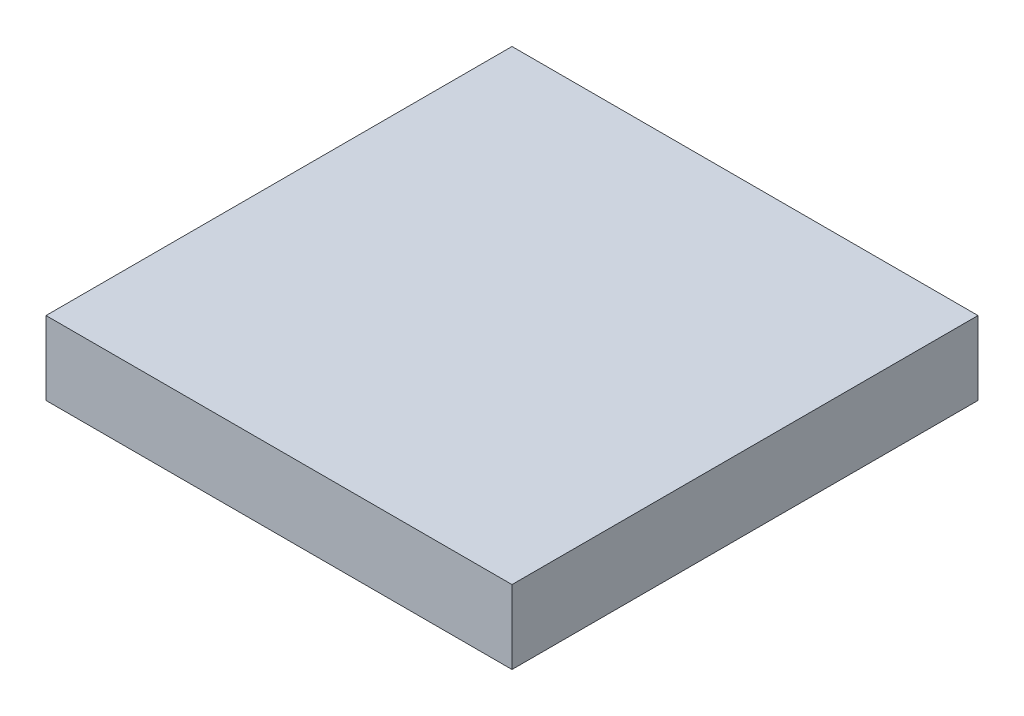
ISO-10303-21;
HEADER;
FILE_DESCRIPTION(('STEP AP214'),'2;1');
FILE_NAME('part.step','',(''),(''),'','','');
FILE_SCHEMA(('AUTOMOTIVE_DESIGN { 1 0 10303 214 1 1 1 1 }'));
ENDSEC;
DATA;
#1=APPLICATION_CONTEXT('core data for automotive mechanical design processes');
#2=APPLICATION_PROTOCOL_DEFINITION('international standard','automotive_design',2000,#1);
#3=PRODUCT_CONTEXT('',#1,'mechanical');
#4=PRODUCT('Part','Part','',(#3));
#5=PRODUCT_RELATED_PRODUCT_CATEGORY('part','',(#4));
#6=PRODUCT_DEFINITION_FORMATION('','',#4);
#7=PRODUCT_DEFINITION_CONTEXT('part definition',#1,'design');
#8=PRODUCT_DEFINITION('design','',#6,#7);
#9=PRODUCT_DEFINITION_SHAPE('','',#8);
#10=(LENGTH_UNIT() NAMED_UNIT(*) SI_UNIT(.MILLI.,.METRE.));
#11=(NAMED_UNIT(*) PLANE_ANGLE_UNIT() SI_UNIT($,.RADIAN.));
#12=(NAMED_UNIT(*) SI_UNIT($,.STERADIAN.) SOLID_ANGLE_UNIT());
#13=UNCERTAINTY_MEASURE_WITH_UNIT(LENGTH_MEASURE(1.E-05),#10,'distance_accuracy_value','');
#14=(GEOMETRIC_REPRESENTATION_CONTEXT(3) GLOBAL_UNCERTAINTY_ASSIGNED_CONTEXT((#13)) GLOBAL_UNIT_ASSIGNED_CONTEXT((#10,
#11,#12)) REPRESENTATION_CONTEXT('',''));
#15=CARTESIAN_POINT('',(0.,0.,0.));
#16=DIRECTION('',(0.,0.,1.));
#17=DIRECTION('',(1.,0.,0.));
#18=AXIS2_PLACEMENT_3D('',#15,#16,#17);
#19=CARTESIAN_POINT('',(-45.,15.,-47.5));
#20=DIRECTION('',(0.,0.,1.));
#21=DIRECTION('',(1.,0.,0.));
#22=AXIS2_PLACEMENT_3D('',#19,#20,#21);
#23=PLANE('',#22);
#24=DIRECTION('',(-1.,0.,0.));
#25=VECTOR('',#24,1.);
#26=CARTESIAN_POINT('',(-45.,0.,-47.5));
#27=LINE('',#26,#25);
#28=CARTESIAN_POINT('',(50.,0.,-47.5));
#29=VERTEX_POINT('',#28);
#30=CARTESIAN_POINT('',(-45.,0.,-47.5));
#31=VERTEX_POINT('',#30);
#32=EDGE_CURVE('E62',#29,#31,#27,.T.);
#33=ORIENTED_EDGE('',*,*,#32,.T.);
#34=DIRECTION('',(0.,-1.,0.));
#35=VECTOR('',#34,1.);
#36=CARTESIAN_POINT('',(-45.,15.,-47.5));
#37=LINE('',#36,#35);
#38=CARTESIAN_POINT('',(-45.,15.,-47.5));
#39=VERTEX_POINT('',#38);
#40=EDGE_CURVE('E11',#39,#31,#37,.T.);
#41=ORIENTED_EDGE('',*,*,#40,.F.);
#42=DIRECTION('',(-1.,0.,0.));
#43=VECTOR('',#42,1.);
#44=CARTESIAN_POINT('',(-45.,15.,-47.5));
#45=LINE('',#44,#43);
#46=CARTESIAN_POINT('',(50.,15.,-47.5));
#47=VERTEX_POINT('',#46);
#48=EDGE_CURVE('E137',#47,#39,#45,.T.);
#49=ORIENTED_EDGE('',*,*,#48,.F.);
#50=DIRECTION('',(0.,1.,0.));
#51=VECTOR('',#50,1.);
#52=CARTESIAN_POINT('',(50.,0.,-47.5));
#53=LINE('',#52,#51);
#54=EDGE_CURVE('E166',#29,#47,#53,.T.);
#55=ORIENTED_EDGE('',*,*,#54,.F.);
#56=EDGE_LOOP('',(#33,#41,#49,#55));
#57=FACE_BOUND('',#56,.T.);
#58=ADVANCED_FACE('F34',(#57),#23,.F.);
#59=CARTESIAN_POINT('',(-45.,15.,47.5));
#60=DIRECTION('',(1.,0.,0.));
#61=DIRECTION('',(0.,0.,-1.));
#62=AXIS2_PLACEMENT_3D('',#59,#60,#61);
#63=PLANE('',#62);
#64=DIRECTION('',(0.,0.,1.));
#65=VECTOR('',#64,1.);
#66=CARTESIAN_POINT('',(-45.,0.,47.5));
#67=LINE('',#66,#65);
#68=CARTESIAN_POINT('',(-45.,0.,47.5));
#69=VERTEX_POINT('',#68);
#70=EDGE_CURVE('E144',#31,#69,#67,.T.);
#71=ORIENTED_EDGE('',*,*,#70,.T.);
#72=DIRECTION('',(0.,-1.,0.));
#73=VECTOR('',#72,1.);
#74=CARTESIAN_POINT('',(-45.,15.,47.5));
#75=LINE('',#74,#73);
#76=CARTESIAN_POINT('',(-45.,15.,47.5));
#77=VERTEX_POINT('',#76);
#78=EDGE_CURVE('E43',#77,#69,#75,.T.);
#79=ORIENTED_EDGE('',*,*,#78,.F.);
#80=DIRECTION('',(0.,0.,1.));
#81=VECTOR('',#80,1.);
#82=CARTESIAN_POINT('',(-45.,15.,47.5));
#83=LINE('',#82,#81);
#84=EDGE_CURVE('E51',#39,#77,#83,.T.);
#85=ORIENTED_EDGE('',*,*,#84,.F.);
#86=ORIENTED_EDGE('',*,*,#40,.T.);
#87=EDGE_LOOP('',(#71,#79,#85,#86));
#88=FACE_BOUND('',#87,.T.);
#89=ADVANCED_FACE('F209',(#88),#63,.F.);
#90=CARTESIAN_POINT('',(-45.,15.,47.5));
#91=DIRECTION('',(0.,0.,-1.));
#92=DIRECTION('',(-1.,0.,0.));
#93=AXIS2_PLACEMENT_3D('',#90,#91,#92);
#94=PLANE('',#93);
#95=DIRECTION('',(1.,0.,0.));
#96=VECTOR('',#95,1.);
#97=CARTESIAN_POINT('',(-45.,0.,47.5));
#98=LINE('',#97,#96);
#99=CARTESIAN_POINT('',(50.,0.,47.5));
#100=VERTEX_POINT('',#99);
#101=EDGE_CURVE('E139',#69,#100,#98,.T.);
#102=ORIENTED_EDGE('',*,*,#101,.T.);
#103=DIRECTION('',(0.,-1.,0.));
#104=VECTOR('',#103,1.);
#105=CARTESIAN_POINT('',(50.,0.,47.5));
#106=LINE('',#105,#104);
#107=CARTESIAN_POINT('',(50.,15.,47.5));
#108=VERTEX_POINT('',#107);
#109=EDGE_CURVE('E167',#108,#100,#106,.T.);
#110=ORIENTED_EDGE('',*,*,#109,.F.);
#111=DIRECTION('',(1.,0.,0.));
#112=VECTOR('',#111,1.);
#113=CARTESIAN_POINT('',(-45.,15.,47.5));
#114=LINE('',#113,#112);
#115=EDGE_CURVE('E141',#77,#108,#114,.T.);
#116=ORIENTED_EDGE('',*,*,#115,.F.);
#117=ORIENTED_EDGE('',*,*,#78,.T.);
#118=EDGE_LOOP('',(#102,#110,#116,#117));
#119=FACE_BOUND('',#118,.T.);
#120=ADVANCED_FACE('F151',(#119),#94,.F.);
#121=CARTESIAN_POINT('',(0.,15.,0.));
#122=DIRECTION('',(0.,-1.,0.));
#123=DIRECTION('',(0.,0.,-1.));
#124=AXIS2_PLACEMENT_3D('',#121,#122,#123);
#125=PLANE('',#124);
#126=ORIENTED_EDGE('',*,*,#115,.T.);
#127=DIRECTION('',(0.,0.,1.));
#128=VECTOR('',#127,1.);
#129=CARTESIAN_POINT('',(50.,15.,47.5));
#130=LINE('',#129,#128);
#131=EDGE_CURVE('E130',#47,#108,#130,.T.);
#132=ORIENTED_EDGE('',*,*,#131,.F.);
#133=ORIENTED_EDGE('',*,*,#48,.T.);
#134=ORIENTED_EDGE('',*,*,#84,.T.);
#135=EDGE_LOOP('',(#126,#132,#133,#134));
#136=FACE_BOUND('',#135,.T.);
#137=ADVANCED_FACE('F178',(#136),#125,.F.);
#138=CARTESIAN_POINT('',(0.,0.,0.));
#139=DIRECTION('',(0.,-1.,0.));
#140=DIRECTION('',(0.,0.,-1.));
#141=AXIS2_PLACEMENT_3D('',#138,#139,#140);
#142=PLANE('',#141);
#143=ORIENTED_EDGE('',*,*,#32,.F.);
#144=DIRECTION('',(0.,0.,-1.));
#145=VECTOR('',#144,1.);
#146=CARTESIAN_POINT('',(50.,0.,47.5));
#147=LINE('',#146,#145);
#148=EDGE_CURVE('E160',#100,#29,#147,.T.);
#149=ORIENTED_EDGE('',*,*,#148,.F.);
#150=ORIENTED_EDGE('',*,*,#101,.F.);
#151=ORIENTED_EDGE('',*,*,#70,.F.);
#152=EDGE_LOOP('',(#143,#149,#150,#151));
#153=FACE_BOUND('',#152,.T.);
#154=ADVANCED_FACE('F158',(#153),#142,.T.);
#155=CARTESIAN_POINT('',(50.,0.,0.));
#156=DIRECTION('',(-1.,0.,0.));
#157=DIRECTION('',(0.,0.,1.));
#158=AXIS2_PLACEMENT_3D('',#155,#156,#157);
#159=PLANE('',#158);
#160=ORIENTED_EDGE('',*,*,#109,.T.);
#161=ORIENTED_EDGE('',*,*,#148,.T.);
#162=ORIENTED_EDGE('',*,*,#54,.T.);
#163=ORIENTED_EDGE('',*,*,#131,.T.);
#164=EDGE_LOOP('',(#160,#161,#162,#163));
#165=FACE_BOUND('',#164,.T.);
#166=ADVANCED_FACE('F170',(#165),#159,.F.);
#167=CLOSED_SHELL('',(#58,#89,#120,#137,#154,#166));
#168=CARTESIAN_POINT('',(5.,0.,0.));
#169=DIRECTION('',(-1.,0.,0.));
#170=DIRECTION('',(0.,0.,1.));
#171=AXIS2_PLACEMENT_3D('',#168,#169,#170);
#172=PLANE('',#171);
#173=DIRECTION('',(0.,-1.,0.));
#174=VECTOR('',#173,1.);
#175=CARTESIAN_POINT('',(5.,2.,6.6));
#176=LINE('',#175,#174);
#177=CARTESIAN_POINT('',(5.,10.4,6.6));
#178=VERTEX_POINT('',#177);
#179=CARTESIAN_POINT('',(5.,2.,6.6));
#180=VERTEX_POINT('',#179);
#181=EDGE_CURVE('E122',#178,#180,#176,.T.);
#182=ORIENTED_EDGE('',*,*,#181,.T.);
#183=DIRECTION('',(0.,0.,-1.));
#184=VECTOR('',#183,1.);
#185=CARTESIAN_POINT('',(5.,2.,6.6));
#186=LINE('',#185,#184);
#187=CARTESIAN_POINT('',(5.,2.,-8.4));
#188=VERTEX_POINT('',#187);
#189=EDGE_CURVE('E106',#180,#188,#186,.T.);
#190=ORIENTED_EDGE('',*,*,#189,.T.);
#191=DIRECTION('',(0.,1.,0.));
#192=VECTOR('',#191,1.);
#193=CARTESIAN_POINT('',(5.,2.,-8.4));
#194=LINE('',#193,#192);
#195=CARTESIAN_POINT('',(5.,10.4,-8.4));
#196=VERTEX_POINT('',#195);
#197=EDGE_CURVE('E114',#188,#196,#194,.T.);
#198=ORIENTED_EDGE('',*,*,#197,.T.);
#199=DIRECTION('',(0.,0.,1.));
#200=VECTOR('',#199,1.);
#201=CARTESIAN_POINT('',(5.,10.4,6.6));
#202=LINE('',#201,#200);
#203=EDGE_CURVE('E119',#196,#178,#202,.T.);
#204=ORIENTED_EDGE('',*,*,#203,.T.);
#205=EDGE_LOOP('',(#182,#190,#198,#204));
#206=FACE_BOUND('',#205,.T.);
#207=ADVANCED_FACE('F121',(#206),#172,.F.);
#208=CARTESIAN_POINT('',(5.,2.,6.6));
#209=DIRECTION('',(0.,-1.,0.));
#210=DIRECTION('',(0.,0.,-1.));
#211=AXIS2_PLACEMENT_3D('',#208,#209,#210);
#212=PLANE('',#211);
#213=DIRECTION('',(0.,0.,-1.));
#214=VECTOR('',#213,1.);
#215=CARTESIAN_POINT('',(45.,2.,6.6));
#216=LINE('',#215,#214);
#217=CARTESIAN_POINT('',(45.,2.,6.6));
#218=VERTEX_POINT('',#217);
#219=CARTESIAN_POINT('',(45.,2.,-8.4));
#220=VERTEX_POINT('',#219);
#221=EDGE_CURVE('E108',#218,#220,#216,.T.);
#222=ORIENTED_EDGE('',*,*,#221,.T.);
#223=DIRECTION('',(1.,0.,0.));
#224=VECTOR('',#223,1.);
#225=CARTESIAN_POINT('',(5.,2.,-8.4));
#226=LINE('',#225,#224);
#227=EDGE_CURVE('E101',#188,#220,#226,.T.);
#228=ORIENTED_EDGE('',*,*,#227,.F.);
#229=ORIENTED_EDGE('',*,*,#189,.F.);
#230=DIRECTION('',(1.,0.,0.));
#231=VECTOR('',#230,1.);
#232=CARTESIAN_POINT('',(5.,2.,6.6));
#233=LINE('',#232,#231);
#234=EDGE_CURVE('E111',#180,#218,#233,.T.);
#235=ORIENTED_EDGE('',*,*,#234,.T.);
#236=EDGE_LOOP('',(#222,#228,#229,#235));
#237=FACE_BOUND('',#236,.T.);
#238=ADVANCED_FACE('F103',(#237),#212,.F.);
#239=CARTESIAN_POINT('',(5.,2.,-8.4));
#240=DIRECTION('',(0.,0.,-1.));
#241=DIRECTION('',(-1.,0.,0.));
#242=AXIS2_PLACEMENT_3D('',#239,#240,#241);
#243=PLANE('',#242);
#244=DIRECTION('',(0.,1.,0.));
#245=VECTOR('',#244,1.);
#246=CARTESIAN_POINT('',(45.,2.,-8.4));
#247=LINE('',#246,#245);
#248=CARTESIAN_POINT('',(45.,10.4,-8.4));
#249=VERTEX_POINT('',#248);
#250=EDGE_CURVE('E85',#220,#249,#247,.T.);
#251=ORIENTED_EDGE('',*,*,#250,.T.);
#252=DIRECTION('',(1.,0.,0.));
#253=VECTOR('',#252,1.);
#254=CARTESIAN_POINT('',(5.,10.4,-8.4));
#255=LINE('',#254,#253);
#256=EDGE_CURVE('E110',#196,#249,#255,.T.);
#257=ORIENTED_EDGE('',*,*,#256,.F.);
#258=ORIENTED_EDGE('',*,*,#197,.F.);
#259=ORIENTED_EDGE('',*,*,#227,.T.);
#260=EDGE_LOOP('',(#251,#257,#258,#259));
#261=FACE_BOUND('',#260,.T.);
#262=ADVANCED_FACE('F115',(#261),#243,.F.);
#263=CARTESIAN_POINT('',(5.,10.4,6.6));
#264=DIRECTION('',(0.,1.,0.));
#265=DIRECTION('',(0.,0.,1.));
#266=AXIS2_PLACEMENT_3D('',#263,#264,#265);
#267=PLANE('',#266);
#268=DIRECTION('',(0.,0.,1.));
#269=VECTOR('',#268,1.);
#270=CARTESIAN_POINT('',(45.,10.4,6.6));
#271=LINE('',#270,#269);
#272=CARTESIAN_POINT('',(45.,10.4,6.6));
#273=VERTEX_POINT('',#272);
#274=EDGE_CURVE('E124',#249,#273,#271,.T.);
#275=ORIENTED_EDGE('',*,*,#274,.T.);
#276=DIRECTION('',(1.,0.,0.));
#277=VECTOR('',#276,1.);
#278=CARTESIAN_POINT('',(5.,10.4,6.6));
#279=LINE('',#278,#277);
#280=EDGE_CURVE('E71',#178,#273,#279,.T.);
#281=ORIENTED_EDGE('',*,*,#280,.F.);
#282=ORIENTED_EDGE('',*,*,#203,.F.);
#283=ORIENTED_EDGE('',*,*,#256,.T.);
#284=EDGE_LOOP('',(#275,#281,#282,#283));
#285=FACE_BOUND('',#284,.T.);
#286=ADVANCED_FACE('F184',(#285),#267,.F.);
#287=CARTESIAN_POINT('',(5.,2.,6.6));
#288=DIRECTION('',(0.,0.,1.));
#289=DIRECTION('',(1.,0.,0.));
#290=AXIS2_PLACEMENT_3D('',#287,#288,#289);
#291=PLANE('',#290);
#292=DIRECTION('',(0.,-1.,0.));
#293=VECTOR('',#292,1.);
#294=CARTESIAN_POINT('',(45.,2.,6.6));
#295=LINE('',#294,#293);
#296=EDGE_CURVE('E93',#273,#218,#295,.T.);
#297=ORIENTED_EDGE('',*,*,#296,.T.);
#298=ORIENTED_EDGE('',*,*,#234,.F.);
#299=ORIENTED_EDGE('',*,*,#181,.F.);
#300=ORIENTED_EDGE('',*,*,#280,.T.);
#301=EDGE_LOOP('',(#297,#298,#299,#300));
#302=FACE_BOUND('',#301,.T.);
#303=ADVANCED_FACE('F183',(#302),#291,.F.);
#304=CARTESIAN_POINT('',(45.,0.,0.));
#305=DIRECTION('',(-1.,0.,0.));
#306=DIRECTION('',(0.,0.,1.));
#307=AXIS2_PLACEMENT_3D('',#304,#305,#306);
#308=PLANE('',#307);
#309=ORIENTED_EDGE('',*,*,#296,.F.);
#310=ORIENTED_EDGE('',*,*,#274,.F.);
#311=ORIENTED_EDGE('',*,*,#250,.F.);
#312=ORIENTED_EDGE('',*,*,#221,.F.);
#313=EDGE_LOOP('',(#309,#310,#311,#312));
#314=FACE_BOUND('',#313,.T.);
#315=ADVANCED_FACE('F181',(#314),#308,.T.);
#316=CLOSED_SHELL('',(#207,#238,#262,#286,#303,#315));
#317=ORIENTED_CLOSED_SHELL('',*,#316,.T.);
#318=BREP_WITH_VOIDS('B2',#167,(#317));
#319=ADVANCED_BREP_SHAPE_REPRESENTATION('',(#18,#318),#14);
#320=SHAPE_DEFINITION_REPRESENTATION(#9,#319);
ENDSEC;
END-ISO-10303-21;
